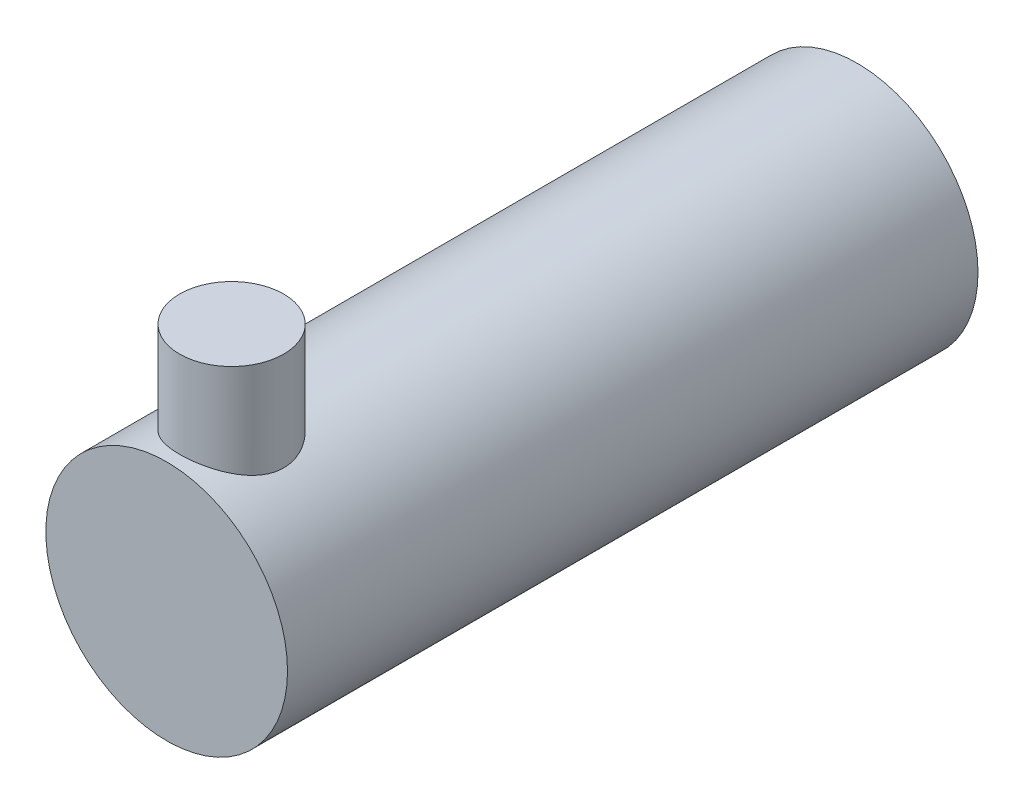
ISO-10303-21;
HEADER;
FILE_DESCRIPTION(('STEP AP214'),'2;1');
FILE_NAME('part.step','',(''),(''),'','','');
FILE_SCHEMA(('AUTOMOTIVE_DESIGN { 1 0 10303 214 1 1 1 1 }'));
ENDSEC;
DATA;
#1=APPLICATION_CONTEXT('core data for automotive mechanical design processes');
#2=APPLICATION_PROTOCOL_DEFINITION('international standard','automotive_design',2000,#1);
#3=PRODUCT_CONTEXT('',#1,'mechanical');
#4=PRODUCT('Part','Part','',(#3));
#5=PRODUCT_RELATED_PRODUCT_CATEGORY('part','',(#4));
#6=PRODUCT_DEFINITION_FORMATION('','',#4);
#7=PRODUCT_DEFINITION_CONTEXT('part definition',#1,'design');
#8=PRODUCT_DEFINITION('design','',#6,#7);
#9=PRODUCT_DEFINITION_SHAPE('','',#8);
#10=(LENGTH_UNIT() NAMED_UNIT(*) SI_UNIT(.MILLI.,.METRE.));
#11=(NAMED_UNIT(*) PLANE_ANGLE_UNIT() SI_UNIT($,.RADIAN.));
#12=(NAMED_UNIT(*) SI_UNIT($,.STERADIAN.) SOLID_ANGLE_UNIT());
#13=UNCERTAINTY_MEASURE_WITH_UNIT(LENGTH_MEASURE(1.E-05),#10,'distance_accuracy_value','');
#14=(GEOMETRIC_REPRESENTATION_CONTEXT(3) GLOBAL_UNCERTAINTY_ASSIGNED_CONTEXT((#13)) GLOBAL_UNIT_ASSIGNED_CONTEXT((#10,
#11,#12)) REPRESENTATION_CONTEXT('',''));
#15=CARTESIAN_POINT('',(0.,0.,0.));
#16=DIRECTION('',(0.,0.,1.));
#17=DIRECTION('',(1.,0.,0.));
#18=AXIS2_PLACEMENT_3D('',#15,#16,#17);
#19=CARTESIAN_POINT('',(0.,0.,80.));
#20=DIRECTION('',(0.,0.,-1.));
#21=DIRECTION('',(-1.,0.,0.));
#22=AXIS2_PLACEMENT_3D('',#19,#20,#21);
#23=CYLINDRICAL_SURFACE('',#22,14.);
#24=CARTESIAN_POINT('',(0.,0.,80.));
#25=DIRECTION('',(0.,0.,1.));
#26=DIRECTION('',(1.,0.,0.));
#27=AXIS2_PLACEMENT_3D('',#24,#25,#26);
#28=CIRCLE('',#27,14.);
#29=CARTESIAN_POINT('',(14.,0.,80.));
#30=VERTEX_POINT('',#29);
#31=EDGE_CURVE('E49',#30,#30,#28,.T.);
#32=ORIENTED_EDGE('',*,*,#31,.F.);
#33=EDGE_LOOP('',(#32));
#34=FACE_BOUND('',#33,.T.);
#35=CARTESIAN_POINT('',(0.,0.,0.));
#36=DIRECTION('',(0.,0.,1.));
#37=DIRECTION('',(1.,0.,0.));
#38=AXIS2_PLACEMENT_3D('',#35,#36,#37);
#39=CIRCLE('',#38,14.);
#40=CARTESIAN_POINT('',(14.,0.,0.));
#41=VERTEX_POINT('',#40);
#42=EDGE_CURVE('E54',#41,#41,#39,.T.);
#43=ORIENTED_EDGE('',*,*,#42,.T.);
#44=EDGE_LOOP('',(#43));
#45=FACE_BOUND('',#44,.T.);
#46=CARTESIAN_POINT('',(0.,14.,66.4416822455323));
#47=CARTESIAN_POINT('',(-0.161140519890755,13.9999990376827,66.4416834201102));
#48=CARTESIAN_POINT('',(-0.322328766508099,13.9972104298286,66.4481479658693));
#49=CARTESIAN_POINT('',(-0.643551281353144,13.9861252498433,66.4739442953689));
#50=CARTESIAN_POINT('',(-0.803584796445211,13.9778253628246,66.493283823086));
#51=CARTESIAN_POINT('',(-1.12155576556596,13.9559147010508,66.5446754903892));
#52=CARTESIAN_POINT('',(-1.27948847624572,13.9422935095439,66.5767525664795));
#53=CARTESIAN_POINT('',(-1.59186596890883,13.9100910142055,66.6532989373523));
#54=CARTESIAN_POINT('',(-1.74630929721375,13.8915076830138,66.6977732975675));
#55=CARTESIAN_POINT('',(-2.05001498614682,13.8499400492928,66.7984766027933));
#56=CARTESIAN_POINT('',(-2.19929529600807,13.8269732991091,66.8546587465464));
#57=CARTESIAN_POINT('',(-2.49244556564793,13.7771489962152,66.9784052894499));
#58=CARTESIAN_POINT('',(-2.63631347581006,13.7502899878643,67.045973948517));
#59=CARTESIAN_POINT('',(-2.91767754624432,13.6933465014219,67.191894975036));
#60=CARTESIAN_POINT('',(-3.05517808323447,13.6632642874397,67.2702397837217));
#61=CARTESIAN_POINT('',(-3.32321436955233,13.6005599077285,67.4371917634656));
#62=CARTESIAN_POINT('',(-3.45374756272429,13.5679368204611,67.5258026636228));
#63=CARTESIAN_POINT('',(-3.84605060573075,13.4641433984249,67.8151725523522));
#64=CARTESIAN_POINT('',(-4.09504740129755,13.3898722005316,68.0325057473166));
#65=CARTESIAN_POINT('',(-4.55433756051167,13.2407143495519,68.5048481713332));
#66=CARTESIAN_POINT('',(-4.76460921543544,13.1658273756932,68.7598783892452));
#67=CARTESIAN_POINT('',(-5.05226273660733,13.0570262328199,69.1736829478229));
#68=CARTESIAN_POINT('',(-5.14547964108718,13.0204763440162,69.3209770776683));
#69=CARTESIAN_POINT('',(-5.31907963128874,12.9505267025055,69.6236243079404));
#70=CARTESIAN_POINT('',(-5.39946805405645,12.9171256421674,69.7789740211674));
#71=CARTESIAN_POINT('',(-5.54671857333245,12.8545836209943,70.0967857280318));
#72=CARTESIAN_POINT('',(-5.61358035203896,12.8254427602549,70.2592478886636));
#73=CARTESIAN_POINT('',(-5.73306405123336,12.7724802177968,70.5900867919054));
#74=CARTESIAN_POINT('',(-5.78569346139233,12.7486557395325,70.7584603707631));
#75=CARTESIAN_POINT('',(-5.87387042293832,12.708260334932,71.0913491353358));
#76=CARTESIAN_POINT('',(-5.91014072856327,12.6913861954141,71.2556360487984));
#77=CARTESIAN_POINT('',(-5.968864859625,12.6638741314811,71.5871057507926));
#78=CARTESIAN_POINT('',(-5.99132520377784,12.6532332648865,71.7542871346715));
#79=CARTESIAN_POINT('',(-6.02216089617816,12.6385865930275,72.0901840412945));
#80=CARTESIAN_POINT('',(-6.03054050151375,12.6345787823693,72.2588990848458));
#81=CARTESIAN_POINT('',(-6.03311433669809,12.6333501385742,72.5964572792816));
#82=CARTESIAN_POINT('',(-6.02730939351918,12.6361289097734,72.7653004221241));
#83=CARTESIAN_POINT('',(-6.00266972448274,12.6478503150776,73.0876267596719));
#84=CARTESIAN_POINT('',(-5.9849614314803,12.6562598522673,73.2412171491831));
#85=CARTESIAN_POINT('',(-5.93788392025113,12.6784151747724,73.5462599661102));
#86=CARTESIAN_POINT('',(-5.90851091174536,12.6921626945551,73.6977116820142));
#87=CARTESIAN_POINT('',(-5.83841287662962,12.7245597832126,73.9973878195363));
#88=CARTESIAN_POINT('',(-5.79769029489898,12.7432082962858,74.1456129288114));
#89=CARTESIAN_POINT('',(-5.70525794463604,12.7848582541108,74.4380213807038));
#90=CARTESIAN_POINT('',(-5.65354392743619,12.8078613817334,74.5822031359239));
#91=CARTESIAN_POINT('',(-5.53833562558708,12.8581050638393,74.8687298028605));
#92=CARTESIAN_POINT('',(-5.47461184922093,12.8854261308537,75.0109684728319));
#93=CARTESIAN_POINT('',(-5.3366558167459,12.9431721947081,75.2895995071724));
#94=CARTESIAN_POINT('',(-5.26242002035469,12.9735982362862,75.425989881684));
#95=CARTESIAN_POINT('',(-5.02460923885673,13.0683725634173,75.8254331488137));
#96=CARTESIAN_POINT('',(-4.84586803804945,13.1362456659617,76.0789134770261));
#97=CARTESIAN_POINT('',(-4.54192700903071,13.2432579006569,76.4466494146828));
#98=CARTESIAN_POINT('',(-4.42925933508864,13.2814529717934,76.5718679358681));
#99=CARTESIAN_POINT('',(-4.19382162649012,13.3576625304478,76.8124869130885));
#100=CARTESIAN_POINT('',(-4.0710544605977,13.3956770660241,76.9278901383481));
#101=CARTESIAN_POINT('',(-3.81601558029319,13.4705494311026,77.1482456660612));
#102=CARTESIAN_POINT('',(-3.68373783759032,13.5074065053013,77.2531912375699));
#103=CARTESIAN_POINT('',(-3.41051565005499,13.5789658516612,77.4518325106704));
#104=CARTESIAN_POINT('',(-3.26957469907773,13.6136689813021,77.5455327030681));
#105=CARTESIAN_POINT('',(-2.97589576268011,13.6809113282097,77.7233855657156));
#106=CARTESIAN_POINT('',(-2.82294297249699,13.7133677471224,77.8072154964801));
#107=CARTESIAN_POINT('',(-2.50973980732817,13.7741293084205,77.9615561727574));
#108=CARTESIAN_POINT('',(-2.34949244946672,13.8024361470418,78.0320723639789));
#109=CARTESIAN_POINT('',(-2.02280780710757,13.8540819006214,78.159106171687));
#110=CARTESIAN_POINT('',(-1.85637213782875,13.8774221013825,78.2156274119195));
#111=CARTESIAN_POINT('',(-1.51855672616394,13.9184382948139,78.3140608030397));
#112=CARTESIAN_POINT('',(-1.34717739031626,13.9361147517982,78.3559741515081));
#113=CARTESIAN_POINT('',(-1.0124508366394,13.9642846705556,78.4223946587792));
#114=CARTESIAN_POINT('',(-0.849330157768733,13.9751785432889,78.4478762098167));
#115=CARTESIAN_POINT('',(-0.521273500946065,13.9912557237322,78.4853890788119));
#116=CARTESIAN_POINT('',(-0.356337631845312,13.9964393720021,78.4974211988993));
#117=CARTESIAN_POINT('',(-0.0259988300136708,14.0009501283041,78.5078946926677));
#118=CARTESIAN_POINT('',(0.139403969177995,14.0002787687724,78.5063396225354));
#119=CARTESIAN_POINT('',(0.469394264020902,13.993101961525,78.4896653623767));
#120=CARTESIAN_POINT('',(0.633981780073948,13.9865966605483,78.4745465135148));
#121=CARTESIAN_POINT('',(0.952183782220836,13.9684414620886,78.4321043284417));
#122=CARTESIAN_POINT('',(1.10591001933421,13.9570890754321,78.4054858561233));
#123=CARTESIAN_POINT('',(1.41048116071126,13.9296062366947,78.3405287949249));
#124=CARTESIAN_POINT('',(1.56132511381475,13.9134742353585,78.3021864057474));
#125=CARTESIAN_POINT('',(1.85906610004955,13.8768284609646,78.2141577929052));
#126=CARTESIAN_POINT('',(2.00596424841306,13.8563159409931,78.1644748130378));
#127=CARTESIAN_POINT('',(2.29503519881732,13.8113800917578,78.0541703447096));
#128=CARTESIAN_POINT('',(2.43720617455701,13.786955271733,77.9935446854778));
#129=CARTESIAN_POINT('',(2.72028286204509,13.7339517993869,77.8598130840486));
#130=CARTESIAN_POINT('',(2.8610142020333,13.7052682388028,77.7863797968918));
#131=CARTESIAN_POINT('',(3.13584111943106,13.6450101191731,77.6289396585193));
#132=CARTESIAN_POINT('',(3.2699344085535,13.613434573739,77.5449291959887));
#133=CARTESIAN_POINT('',(3.53078255864889,13.5481237161575,77.3669020558539));
#134=CARTESIAN_POINT('',(3.65753606349729,13.5143880072999,77.2728835381763));
#135=CARTESIAN_POINT('',(3.90307166074186,13.4455305912631,77.0754146011327));
#136=CARTESIAN_POINT('',(4.02185333112842,13.4104088108647,76.9719636831209));
#137=CARTESIAN_POINT('',(4.25962957283891,13.3368737540164,76.7479443636316));
#138=CARTESIAN_POINT('',(4.37794756478078,13.2984139563135,76.6266720603441));
#139=CARTESIAN_POINT('',(4.60398456964821,13.2218593290847,76.3745872820128));
#140=CARTESIAN_POINT('',(4.71170673204318,13.1837643941655,76.2437776620615));
#141=CARTESIAN_POINT('',(4.91601148621401,13.1089540275088,75.9732058049226));
#142=CARTESIAN_POINT('',(5.01258639786234,13.0722395584762,75.8334374973674));
#143=CARTESIAN_POINT('',(5.1938144907779,13.0012983852019,75.5458543418817));
#144=CARTESIAN_POINT('',(5.27847263672168,12.9670706478491,75.3980428806315));
#145=CARTESIAN_POINT('',(5.43676578975935,12.9015139349186,75.0922427193118));
#146=CARTESIAN_POINT('',(5.51015700200117,12.8702535114216,74.9341128091108));
#147=CARTESIAN_POINT('',(5.64319428037434,12.812479115267,74.611408118849));
#148=CARTESIAN_POINT('',(5.70284637082269,12.7859630634443,74.4468362006505));
#149=CARTESIAN_POINT('',(5.80776859542248,12.7386474741152,74.112455645177));
#150=CARTESIAN_POINT('',(5.85304625594777,12.7178449458109,73.9426497996265));
#151=CARTESIAN_POINT('',(5.9286968885106,12.6827560014812,73.5990918604573));
#152=CARTESIAN_POINT('',(5.95907140271393,12.6684689112541,73.4253401770985));
#153=CARTESIAN_POINT('',(6.00266422702794,12.64786742949,73.0896139156666));
#154=CARTESIAN_POINT('',(6.01707416590686,12.6410004027036,72.9278270695596));
#155=CARTESIAN_POINT('',(6.0327912261867,12.6335073878194,72.603476930003));
#156=CARTESIAN_POINT('',(6.03409909227575,12.6328810450172,72.4409136812077));
#157=CARTESIAN_POINT('',(6.02359728440638,12.6378917585247,72.1163377324292));
#158=CARTESIAN_POINT('',(6.01178972295394,12.6435278061492,71.9543249479981));
#159=CARTESIAN_POINT('',(5.97520607819886,12.6608578150927,71.6321021328866));
#160=CARTESIAN_POINT('',(5.95043014532948,12.6725517061406,71.4718920813164));
#161=CARTESIAN_POINT('',(5.88986796043795,12.7008072531841,71.1629795630955));
#162=CARTESIAN_POINT('',(5.85474159245237,12.7170750500702,71.014119967662));
#163=CARTESIAN_POINT('',(5.77346245525911,12.7541807224252,70.7199800901146));
#164=CARTESIAN_POINT('',(5.72730614104451,12.7750200670052,70.5747009753554));
#165=CARTESIAN_POINT('',(5.62437880836506,12.8206680236395,70.288616932186));
#166=CARTESIAN_POINT('',(5.56760918828414,12.8454761127195,70.1478114172011));
#167=CARTESIAN_POINT('',(5.44389231118347,12.8983937348175,69.871367532315));
#168=CARTESIAN_POINT('',(5.37694133907302,12.9265044720893,69.7357310712445));
#169=CARTESIAN_POINT('',(5.15259516633594,13.0183694381093,69.3211624807155));
#170=CARTESIAN_POINT('',(4.97804194189732,13.0867105791548,69.0523025474567));
#171=CARTESIAN_POINT('',(4.58934670177298,13.2280205506478,68.5462372230499));
#172=CARTESIAN_POINT('',(4.37518948554226,13.3009911508556,68.3090440464241));
#173=CARTESIAN_POINT('',(4.01847653314026,13.411527825228,67.9718403874594));
#174=CARTESIAN_POINT('',(3.88822053800983,13.4499594415606,67.8588647817622));
#175=CARTESIAN_POINT('',(3.61822566106589,13.5250895015215,67.6442744060872));
#176=CARTESIAN_POINT('',(3.47849017923552,13.5617885586365,67.5426555970555));
#177=CARTESIAN_POINT('',(3.19019907988551,13.632486273663,67.3514157666885));
#178=CARTESIAN_POINT('',(3.04163538567533,13.6664823901369,67.2618059838138));
#179=CARTESIAN_POINT('',(2.73677986079626,13.7307787367074,67.0954673751756));
#180=CARTESIAN_POINT('',(2.58049164114922,13.7610806711995,67.0187326030347));
#181=CARTESIAN_POINT('',(2.26334735680617,13.8167587778644,66.8797705409129));
#182=CARTESIAN_POINT('',(2.10258257813773,13.842196454858,66.8173597813703));
#183=CARTESIAN_POINT('',(1.77570410316429,13.8879115945625,66.7063890041581));
#184=CARTESIAN_POINT('',(1.60959300596778,13.9081915232643,66.6578223660749));
#185=CARTESIAN_POINT('',(1.27365568477413,13.9429642361669,66.5751502432303));
#186=CARTESIAN_POINT('',(1.10383956301012,13.9574710810226,66.5410096104589));
#187=CARTESIAN_POINT('',(0.76157759809747,13.9803208657967,66.4874490364322));
#188=CARTESIAN_POINT('',(0.589133722876426,13.9886682073356,66.4680185829305));
#189=CARTESIAN_POINT('',(0.346908209475002,13.9958731989956,66.4512655755688));
#190=CARTESIAN_POINT('',(0.27758777115698,13.9974197281429,66.4476729995561));
#191=CARTESIAN_POINT('',(0.138847842293512,13.9994833395155,66.442881073224));
#192=CARTESIAN_POINT('',(0.0694283510662485,14.0000004146201,66.4416817394584));
#193=CARTESIAN_POINT('',(0.,14.,66.4416822455323));
#194=B_SPLINE_CURVE_WITH_KNOTS('',3,(#46,#47,#48,#49,#50,#51,#52,#53,#54,#55,#56,#57,#58,#59,
#60,#61,#62,#63,#64,#65,#66,#67,#68,#69,#70,#71,#72,#73,#74,#75,#76,#77,#78,#79,#80,#81,#82,#83,
#84,#85,#86,#87,#88,#89,#90,#91,#92,#93,#94,#95,#96,#97,#98,#99,#100,#101,#102,#103,#104,#105,
#106,#107,#108,#109,#110,#111,#112,#113,#114,#115,#116,#117,#118,#119,#120,#121,#122,#123,#124,
#125,#126,#127,#128,#129,#130,#131,#132,#133,#134,#135,#136,#137,#138,#139,#140,#141,#142,#143,
#144,#145,#146,#147,#148,#149,#150,#151,#152,#153,#154,#155,#156,#157,#158,#159,#160,#161,#162,
#163,#164,#165,#166,#167,#168,#169,#170,#171,#172,#173,#174,#175,#176,#177,#178,#179,#180,#181,
#182,#183,#184,#185,#186,#187,#188,#189,#190,#191,#192,#193),.UNSPECIFIED.,.T.,.F.,(4,2,2,2,2,2,
2,2,2,2,2,2,2,2,2,2,2,2,2,2,2,2,2,2,2,2,2,2,2,2,2,2,2,2,2,2,2,2,2,2,2,2,2,2,2,2,2,2,2,2,2,2,2,2,
2,2,2,2,2,2,2,2,2,2,2,2,2,2,2,2,2,2,2,4),(0.,0.48335141873788,0.966993824129819,
1.45158776934545,1.93638000678995,2.41927026153599,2.90234157762528,3.38507576241578,
3.86798585067768,4.87957200862345,5.89172353160226,6.42546552955301,6.95898489211099,
7.49251678798555,8.02576736813873,8.53234482343145,9.03868297502719,9.54486801575024,
10.0510235461196,10.5149884009122,10.9791041378279,11.4431199739739,11.9073154996731,
12.3814970958516,12.8558387704088,13.8040174960671,14.3217360180035,14.8393079862579,
15.3572109605508,15.8749064188514,16.4064607152611,16.9377971171516,17.4689957946351,
18.0001509132702,18.495883952697,18.9915874248216,19.4871611599479,19.982722430448,
20.451461264193,20.9203522005877,21.3891091858049,21.8580452151429,22.341449371551,
22.8250190242137,23.3086777396944,23.7923620387332,24.3129869034831,24.8334565488001,
25.3542826685934,25.8748911592857,26.4055296841834,26.935935090358,27.4660623193408,
27.9961346796014,28.4832164300947,28.9702704959567,29.4572461232439,29.9442161017336,
30.4051361432991,30.8662045235334,31.3272121972544,31.7883884942763,32.7672889480519,
33.7465658997272,34.2759948511016,34.8052349073811,35.334966836758,35.8644534297254,
36.3867236267236,36.9087436476696,37.4294843633509,37.9498525930588,38.1581059851523,
38.3663608177124),.UNSPECIFIED.);
#195=CARTESIAN_POINT('',(0.,14.,66.4416822455323));
#196=VERTEX_POINT('',#195);
#197=EDGE_CURVE('E10',#196,#196,#194,.T.);
#198=ORIENTED_EDGE('',*,*,#197,.F.);
#199=EDGE_LOOP('',(#198));
#200=FACE_BOUND('',#199,.T.);
#201=ADVANCED_FACE('F37',(#34,#45,#200),#23,.T.);
#202=CARTESIAN_POINT('',(0.,0.,80.));
#203=DIRECTION('',(0.,0.,1.));
#204=DIRECTION('',(1.,0.,0.));
#205=AXIS2_PLACEMENT_3D('',#202,#203,#204);
#206=PLANE('',#205);
#207=ORIENTED_EDGE('',*,*,#31,.T.);
#208=EDGE_LOOP('',(#207));
#209=FACE_BOUND('',#208,.T.);
#210=ADVANCED_FACE('F77',(#209),#206,.T.);
#211=CARTESIAN_POINT('',(0.,0.,0.));
#212=DIRECTION('',(0.,0.,1.));
#213=DIRECTION('',(1.,0.,0.));
#214=AXIS2_PLACEMENT_3D('',#211,#212,#213);
#215=PLANE('',#214);
#216=ORIENTED_EDGE('',*,*,#42,.F.);
#217=EDGE_LOOP('',(#216));
#218=FACE_BOUND('',#217,.T.);
#219=ADVANCED_FACE('F70',(#218),#215,.F.);
#220=CARTESIAN_POINT('',(0.,24.0594448425217,72.4736851178704));
#221=DIRECTION('',(0.,-1.,0.));
#222=DIRECTION('',(0.,0.,-1.));
#223=AXIS2_PLACEMENT_3D('',#220,#221,#222);
#224=CYLINDRICAL_SURFACE('',#223,6.03200287233819);
#225=CARTESIAN_POINT('',(0.,24.0594448425217,72.4736851178704));
#226=DIRECTION('',(0.,1.,0.));
#227=DIRECTION('',(0.,0.,1.));
#228=AXIS2_PLACEMENT_3D('',#225,#226,#227);
#229=CIRCLE('',#228,6.03200287233819);
#230=CARTESIAN_POINT('',(0.,24.0594448425217,78.5056879902086));
#231=VERTEX_POINT('',#230);
#232=EDGE_CURVE('E60',#231,#231,#229,.T.);
#233=ORIENTED_EDGE('',*,*,#232,.F.);
#234=EDGE_LOOP('',(#233));
#235=FACE_BOUND('',#234,.T.);
#236=ORIENTED_EDGE('',*,*,#197,.T.);
#237=EDGE_LOOP('',(#236));
#238=FACE_BOUND('',#237,.T.);
#239=ADVANCED_FACE('F68',(#235,#238),#224,.T.);
#240=CARTESIAN_POINT('',(0.,24.0594448425217,72.4736851178704));
#241=DIRECTION('',(0.,1.,0.));
#242=DIRECTION('',(0.,0.,1.));
#243=AXIS2_PLACEMENT_3D('',#240,#241,#242);
#244=PLANE('',#243);
#245=ORIENTED_EDGE('',*,*,#232,.T.);
#246=EDGE_LOOP('',(#245));
#247=FACE_BOUND('',#246,.T.);
#248=ADVANCED_FACE('F66',(#247),#244,.T.);
#249=CLOSED_SHELL('',(#201,#210,#219,#239,#248));
#250=MANIFOLD_SOLID_BREP('B2',#249);
#251=ADVANCED_BREP_SHAPE_REPRESENTATION('',(#18,#250),#14);
#252=SHAPE_DEFINITION_REPRESENTATION(#9,#251);
ENDSEC;
END-ISO-10303-21;
